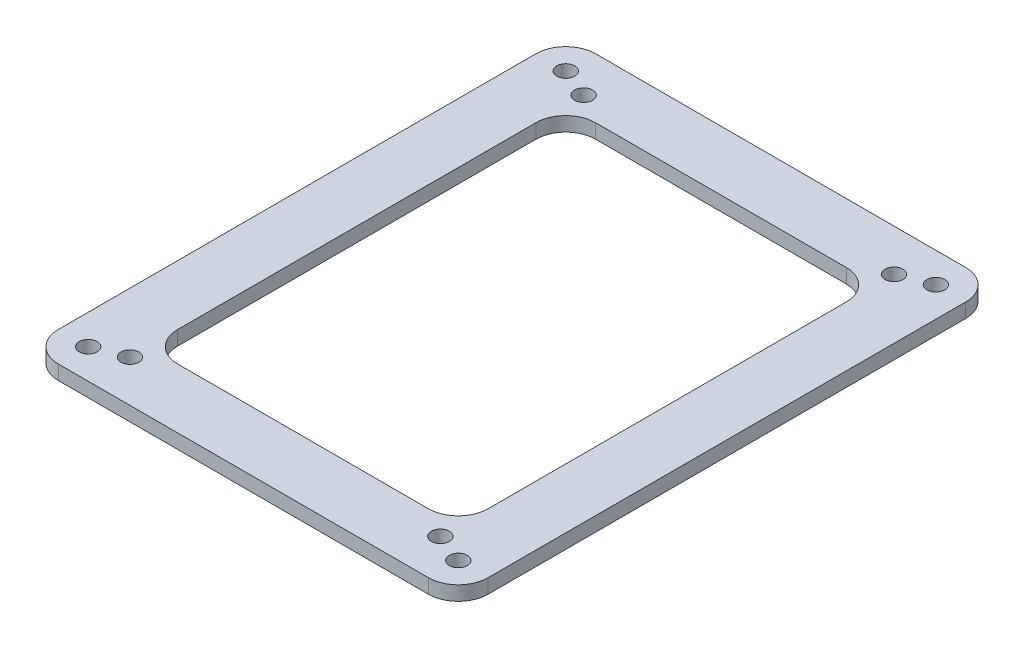
ISO-10303-21;
HEADER;
FILE_DESCRIPTION(('STEP AP214'),'2;1');
FILE_NAME('part.step','',(''),(''),'','','');
FILE_SCHEMA(('AUTOMOTIVE_DESIGN { 1 0 10303 214 1 1 1 1 }'));
ENDSEC;
DATA;
#1=APPLICATION_CONTEXT('core data for automotive mechanical design processes');
#2=APPLICATION_PROTOCOL_DEFINITION('international standard','automotive_design',2000,#1);
#3=PRODUCT_CONTEXT('',#1,'mechanical');
#4=PRODUCT('Part','Part','',(#3));
#5=PRODUCT_RELATED_PRODUCT_CATEGORY('part','',(#4));
#6=PRODUCT_DEFINITION_FORMATION('','',#4);
#7=PRODUCT_DEFINITION_CONTEXT('part definition',#1,'design');
#8=PRODUCT_DEFINITION('design','',#6,#7);
#9=PRODUCT_DEFINITION_SHAPE('','',#8);
#10=(LENGTH_UNIT() NAMED_UNIT(*) SI_UNIT(.MILLI.,.METRE.));
#11=(NAMED_UNIT(*) PLANE_ANGLE_UNIT() SI_UNIT($,.RADIAN.));
#12=(NAMED_UNIT(*) SI_UNIT($,.STERADIAN.) SOLID_ANGLE_UNIT());
#13=UNCERTAINTY_MEASURE_WITH_UNIT(LENGTH_MEASURE(1.E-05),#10,'distance_accuracy_value','');
#14=(GEOMETRIC_REPRESENTATION_CONTEXT(3) GLOBAL_UNCERTAINTY_ASSIGNED_CONTEXT((#13)) GLOBAL_UNIT_ASSIGNED_CONTEXT((#10,
#11,#12)) REPRESENTATION_CONTEXT('',''));
#15=CARTESIAN_POINT('',(0.,0.,0.));
#16=DIRECTION('',(0.,0.,1.));
#17=DIRECTION('',(1.,0.,0.));
#18=AXIS2_PLACEMENT_3D('',#15,#16,#17);
#19=CARTESIAN_POINT('',(-31.,2.4,-40.));
#20=DIRECTION('',(0.,-1.,0.));
#21=DIRECTION('',(0.,0.,-1.));
#22=AXIS2_PLACEMENT_3D('',#19,#20,#21);
#23=PLANE('',#22);
#24=CARTESIAN_POINT('',(31.,2.4,40.));
#25=DIRECTION('',(0.,1.,0.));
#26=DIRECTION('',(0.,0.,1.));
#27=AXIS2_PLACEMENT_3D('',#24,#25,#26);
#28=CIRCLE('',#27,1.50000000000001);
#29=CARTESIAN_POINT('',(31.,2.4,41.5));
#30=VERTEX_POINT('',#29);
#31=EDGE_CURVE('E246',#30,#30,#28,.T.);
#32=ORIENTED_EDGE('',*,*,#31,.F.);
#33=EDGE_LOOP('',(#32));
#34=FACE_BOUND('',#33,.T.);
#35=CARTESIAN_POINT('',(-31.,2.4,40.));
#36=DIRECTION('',(0.,1.,0.));
#37=DIRECTION('',(0.,0.,-1.));
#38=AXIS2_PLACEMENT_3D('',#35,#36,#37);
#39=CIRCLE('',#38,1.5);
#40=CARTESIAN_POINT('',(-31.,2.4,38.5));
#41=VERTEX_POINT('',#40);
#42=EDGE_CURVE('E252',#41,#41,#39,.T.);
#43=ORIENTED_EDGE('',*,*,#42,.F.);
#44=EDGE_LOOP('',(#43));
#45=FACE_BOUND('',#44,.T.);
#46=CARTESIAN_POINT('',(31.,2.4,-40.));
#47=DIRECTION('',(0.,1.,0.));
#48=DIRECTION('',(0.,0.,-1.));
#49=AXIS2_PLACEMENT_3D('',#46,#47,#48);
#50=CIRCLE('',#49,1.5);
#51=CARTESIAN_POINT('',(31.,2.4,-41.5));
#52=VERTEX_POINT('',#51);
#53=EDGE_CURVE('E258',#52,#52,#50,.T.);
#54=ORIENTED_EDGE('',*,*,#53,.F.);
#55=EDGE_LOOP('',(#54));
#56=FACE_BOUND('',#55,.T.);
#57=CARTESIAN_POINT('',(-31.,2.4,-40.));
#58=DIRECTION('',(0.,1.,0.));
#59=DIRECTION('',(0.,0.,1.));
#60=AXIS2_PLACEMENT_3D('',#57,#58,#59);
#61=CIRCLE('',#60,1.5);
#62=CARTESIAN_POINT('',(-31.,2.4,-38.5));
#63=VERTEX_POINT('',#62);
#64=EDGE_CURVE('E264',#63,#63,#61,.T.);
#65=ORIENTED_EDGE('',*,*,#64,.F.);
#66=EDGE_LOOP('',(#65));
#67=FACE_BOUND('',#66,.T.);
#68=CARTESIAN_POINT('',(-26.,2.4,38.));
#69=DIRECTION('',(0.,1.,0.));
#70=DIRECTION('',(0.,0.,-1.));
#71=AXIS2_PLACEMENT_3D('',#68,#69,#70);
#72=CIRCLE('',#71,1.5);
#73=CARTESIAN_POINT('',(-26.,2.4,36.5));
#74=VERTEX_POINT('',#73);
#75=EDGE_CURVE('E270',#74,#74,#72,.T.);
#76=ORIENTED_EDGE('',*,*,#75,.F.);
#77=EDGE_LOOP('',(#76));
#78=FACE_BOUND('',#77,.T.);
#79=CARTESIAN_POINT('',(26.,2.4,38.));
#80=DIRECTION('',(0.,1.,0.));
#81=DIRECTION('',(0.,0.,1.));
#82=AXIS2_PLACEMENT_3D('',#79,#80,#81);
#83=CIRCLE('',#82,1.5);
#84=CARTESIAN_POINT('',(26.,2.4,39.5));
#85=VERTEX_POINT('',#84);
#86=EDGE_CURVE('E276',#85,#85,#83,.T.);
#87=ORIENTED_EDGE('',*,*,#86,.F.);
#88=EDGE_LOOP('',(#87));
#89=FACE_BOUND('',#88,.T.);
#90=CARTESIAN_POINT('',(26.,2.4,-38.));
#91=DIRECTION('',(0.,1.,0.));
#92=DIRECTION('',(0.,0.,-1.));
#93=AXIS2_PLACEMENT_3D('',#90,#91,#92);
#94=CIRCLE('',#93,1.5);
#95=CARTESIAN_POINT('',(26.,2.4,-39.5));
#96=VERTEX_POINT('',#95);
#97=EDGE_CURVE('E282',#96,#96,#94,.T.);
#98=ORIENTED_EDGE('',*,*,#97,.F.);
#99=EDGE_LOOP('',(#98));
#100=FACE_BOUND('',#99,.T.);
#101=CARTESIAN_POINT('',(-26.,2.4,-38.));
#102=DIRECTION('',(0.,1.,0.));
#103=DIRECTION('',(0.,0.,1.));
#104=AXIS2_PLACEMENT_3D('',#101,#102,#103);
#105=CIRCLE('',#104,1.5);
#106=CARTESIAN_POINT('',(-26.,2.4,-36.5));
#107=VERTEX_POINT('',#106);
#108=EDGE_CURVE('E288',#107,#107,#105,.T.);
#109=ORIENTED_EDGE('',*,*,#108,.F.);
#110=EDGE_LOOP('',(#109));
#111=FACE_BOUND('',#110,.T.);
#112=CARTESIAN_POINT('',(-31.,2.4,-40.));
#113=DIRECTION('',(0.,1.,0.));
#114=DIRECTION('',(0.,0.,-1.));
#115=AXIS2_PLACEMENT_3D('',#112,#113,#114);
#116=CIRCLE('',#115,4.99999999999999);
#117=CARTESIAN_POINT('',(-31.,2.4,-45.));
#118=VERTEX_POINT('',#117);
#119=CARTESIAN_POINT('',(-36.,2.4,-40.));
#120=VERTEX_POINT('',#119);
#121=EDGE_CURVE('E160',#118,#120,#116,.T.);
#122=ORIENTED_EDGE('',*,*,#121,.T.);
#123=DIRECTION('',(0.,0.,1.));
#124=VECTOR('',#123,1.);
#125=CARTESIAN_POINT('',(-36.,2.4,-40.));
#126=LINE('',#125,#124);
#127=CARTESIAN_POINT('',(-36.,2.4,40.));
#128=VERTEX_POINT('',#127);
#129=EDGE_CURVE('E149',#120,#128,#126,.T.);
#130=ORIENTED_EDGE('',*,*,#129,.T.);
#131=CARTESIAN_POINT('',(-31.,2.4,40.));
#132=DIRECTION('',(0.,1.,0.));
#133=DIRECTION('',(0.,0.,1.));
#134=AXIS2_PLACEMENT_3D('',#131,#132,#133);
#135=CIRCLE('',#134,5.);
#136=CARTESIAN_POINT('',(-31.,2.4,45.));
#137=VERTEX_POINT('',#136);
#138=EDGE_CURVE('E159',#128,#137,#135,.T.);
#139=ORIENTED_EDGE('',*,*,#138,.T.);
#140=DIRECTION('',(1.,0.,0.));
#141=VECTOR('',#140,1.);
#142=CARTESIAN_POINT('',(-31.,2.4,45.));
#143=LINE('',#142,#141);
#144=CARTESIAN_POINT('',(31.,2.4,45.));
#145=VERTEX_POINT('',#144);
#146=EDGE_CURVE('E294',#137,#145,#143,.T.);
#147=ORIENTED_EDGE('',*,*,#146,.T.);
#148=CARTESIAN_POINT('',(31.,2.4,40.));
#149=DIRECTION('',(0.,1.,0.));
#150=DIRECTION('',(0.,0.,-1.));
#151=AXIS2_PLACEMENT_3D('',#148,#149,#150);
#152=CIRCLE('',#151,5.);
#153=CARTESIAN_POINT('',(36.,2.4,40.));
#154=VERTEX_POINT('',#153);
#155=EDGE_CURVE('E296',#145,#154,#152,.T.);
#156=ORIENTED_EDGE('',*,*,#155,.T.);
#157=DIRECTION('',(0.,0.,-1.));
#158=VECTOR('',#157,1.);
#159=CARTESIAN_POINT('',(36.,2.4,-40.));
#160=LINE('',#159,#158);
#161=CARTESIAN_POINT('',(36.,2.4,-40.));
#162=VERTEX_POINT('',#161);
#163=EDGE_CURVE('E298',#154,#162,#160,.T.);
#164=ORIENTED_EDGE('',*,*,#163,.T.);
#165=CARTESIAN_POINT('',(31.,2.4,-40.));
#166=DIRECTION('',(0.,1.,0.));
#167=DIRECTION('',(0.,0.,1.));
#168=AXIS2_PLACEMENT_3D('',#165,#166,#167);
#169=CIRCLE('',#168,4.99999999999999);
#170=CARTESIAN_POINT('',(31.,2.4,-45.));
#171=VERTEX_POINT('',#170);
#172=EDGE_CURVE('E300',#162,#171,#169,.T.);
#173=ORIENTED_EDGE('',*,*,#172,.T.);
#174=DIRECTION('',(-1.,0.,0.));
#175=VECTOR('',#174,1.);
#176=CARTESIAN_POINT('',(-31.,2.4,-45.));
#177=LINE('',#176,#175);
#178=EDGE_CURVE('E164',#171,#118,#177,.T.);
#179=ORIENTED_EDGE('',*,*,#178,.T.);
#180=EDGE_LOOP('',(#122,#130,#139,#147,#156,#164,#173,#179));
#181=FACE_BOUND('',#180,.T.);
#182=DIRECTION('',(-1.,0.,0.));
#183=VECTOR('',#182,1.);
#184=CARTESIAN_POINT('',(-26.,2.4,-35.));
#185=LINE('',#184,#183);
#186=CARTESIAN_POINT('',(21.,2.4,-35.));
#187=VERTEX_POINT('',#186);
#188=CARTESIAN_POINT('',(-21.,2.4,-35.));
#189=VERTEX_POINT('',#188);
#190=EDGE_CURVE('E230',#187,#189,#185,.T.);
#191=ORIENTED_EDGE('',*,*,#190,.F.);
#192=CARTESIAN_POINT('',(21.,2.4,-30.));
#193=DIRECTION('',(0.,-1.,0.));
#194=DIRECTION('',(0.,0.,-1.));
#195=AXIS2_PLACEMENT_3D('',#192,#193,#194);
#196=CIRCLE('',#195,5.);
#197=CARTESIAN_POINT('',(26.,2.4,-30.));
#198=VERTEX_POINT('',#197);
#199=EDGE_CURVE('E203',#187,#198,#196,.T.);
#200=ORIENTED_EDGE('',*,*,#199,.T.);
#201=DIRECTION('',(0.,0.,-1.));
#202=VECTOR('',#201,1.);
#203=CARTESIAN_POINT('',(26.,2.4,-35.));
#204=LINE('',#203,#202);
#205=CARTESIAN_POINT('',(26.,2.4,30.));
#206=VERTEX_POINT('',#205);
#207=EDGE_CURVE('E232',#206,#198,#204,.T.);
#208=ORIENTED_EDGE('',*,*,#207,.F.);
#209=CARTESIAN_POINT('',(21.,2.4,30.));
#210=DIRECTION('',(0.,-1.,0.));
#211=DIRECTION('',(0.,0.,-1.));
#212=AXIS2_PLACEMENT_3D('',#209,#210,#211);
#213=CIRCLE('',#212,5.);
#214=CARTESIAN_POINT('',(21.,2.4,35.));
#215=VERTEX_POINT('',#214);
#216=EDGE_CURVE('E50',#206,#215,#213,.T.);
#217=ORIENTED_EDGE('',*,*,#216,.T.);
#218=DIRECTION('',(1.,0.,0.));
#219=VECTOR('',#218,1.);
#220=CARTESIAN_POINT('',(-26.,2.4,35.));
#221=LINE('',#220,#219);
#222=CARTESIAN_POINT('',(-21.,2.4,35.));
#223=VERTEX_POINT('',#222);
#224=EDGE_CURVE('E226',#223,#215,#221,.T.);
#225=ORIENTED_EDGE('',*,*,#224,.F.);
#226=CARTESIAN_POINT('',(-21.,2.4,30.));
#227=DIRECTION('',(0.,-1.,0.));
#228=DIRECTION('',(0.,0.,-1.));
#229=AXIS2_PLACEMENT_3D('',#226,#227,#228);
#230=CIRCLE('',#229,5.);
#231=CARTESIAN_POINT('',(-26.,2.4,30.));
#232=VERTEX_POINT('',#231);
#233=EDGE_CURVE('E11',#223,#232,#230,.T.);
#234=ORIENTED_EDGE('',*,*,#233,.T.);
#235=DIRECTION('',(0.,0.,1.));
#236=VECTOR('',#235,1.);
#237=CARTESIAN_POINT('',(-26.,2.4,-35.));
#238=LINE('',#237,#236);
#239=CARTESIAN_POINT('',(-26.,2.4,-30.));
#240=VERTEX_POINT('',#239);
#241=EDGE_CURVE('E224',#240,#232,#238,.T.);
#242=ORIENTED_EDGE('',*,*,#241,.F.);
#243=CARTESIAN_POINT('',(-21.,2.4,-30.));
#244=DIRECTION('',(0.,-1.,0.));
#245=DIRECTION('',(0.,0.,-1.));
#246=AXIS2_PLACEMENT_3D('',#243,#244,#245);
#247=CIRCLE('',#246,5.);
#248=EDGE_CURVE('E199',#240,#189,#247,.T.);
#249=ORIENTED_EDGE('',*,*,#248,.T.);
#250=EDGE_LOOP('',(#191,#200,#208,#217,#225,#234,#242,#249));
#251=FACE_BOUND('',#250,.T.);
#252=ADVANCED_FACE('F35',(#34,#45,#56,#67,#78,#89,#100,#111,#181,#251),#23,.F.);
#253=CARTESIAN_POINT('',(-31.,0.,-40.));
#254=DIRECTION('',(0.,-1.,0.));
#255=DIRECTION('',(0.,0.,-1.));
#256=AXIS2_PLACEMENT_3D('',#253,#254,#255);
#257=PLANE('',#256);
#258=CARTESIAN_POINT('',(-31.,0.,40.));
#259=DIRECTION('',(0.,1.,0.));
#260=DIRECTION('',(0.,0.,-1.));
#261=AXIS2_PLACEMENT_3D('',#258,#259,#260);
#262=CIRCLE('',#261,1.5);
#263=CARTESIAN_POINT('',(-31.,0.,38.5));
#264=VERTEX_POINT('',#263);
#265=EDGE_CURVE('E249',#264,#264,#262,.T.);
#266=ORIENTED_EDGE('',*,*,#265,.T.);
#267=EDGE_LOOP('',(#266));
#268=FACE_BOUND('',#267,.T.);
#269=CARTESIAN_POINT('',(-31.,0.,-40.));
#270=DIRECTION('',(0.,1.,0.));
#271=DIRECTION('',(0.,0.,1.));
#272=AXIS2_PLACEMENT_3D('',#269,#270,#271);
#273=CIRCLE('',#272,1.5);
#274=CARTESIAN_POINT('',(-31.,0.,-38.5));
#275=VERTEX_POINT('',#274);
#276=EDGE_CURVE('E261',#275,#275,#273,.T.);
#277=ORIENTED_EDGE('',*,*,#276,.T.);
#278=EDGE_LOOP('',(#277));
#279=FACE_BOUND('',#278,.T.);
#280=CARTESIAN_POINT('',(26.,0.,38.));
#281=DIRECTION('',(0.,1.,0.));
#282=DIRECTION('',(0.,0.,1.));
#283=AXIS2_PLACEMENT_3D('',#280,#281,#282);
#284=CIRCLE('',#283,1.5);
#285=CARTESIAN_POINT('',(26.,0.,39.5));
#286=VERTEX_POINT('',#285);
#287=EDGE_CURVE('E273',#286,#286,#284,.T.);
#288=ORIENTED_EDGE('',*,*,#287,.T.);
#289=EDGE_LOOP('',(#288));
#290=FACE_BOUND('',#289,.T.);
#291=CARTESIAN_POINT('',(-26.,0.,-38.));
#292=DIRECTION('',(0.,1.,0.));
#293=DIRECTION('',(0.,0.,1.));
#294=AXIS2_PLACEMENT_3D('',#291,#292,#293);
#295=CIRCLE('',#294,1.5);
#296=CARTESIAN_POINT('',(-26.,0.,-36.5));
#297=VERTEX_POINT('',#296);
#298=EDGE_CURVE('E285',#297,#297,#295,.T.);
#299=ORIENTED_EDGE('',*,*,#298,.T.);
#300=EDGE_LOOP('',(#299));
#301=FACE_BOUND('',#300,.T.);
#302=CARTESIAN_POINT('',(-31.,0.,-40.));
#303=DIRECTION('',(0.,1.,0.));
#304=DIRECTION('',(0.,0.,-1.));
#305=AXIS2_PLACEMENT_3D('',#302,#303,#304);
#306=CIRCLE('',#305,4.99999999999999);
#307=CARTESIAN_POINT('',(-31.,0.,-45.));
#308=VERTEX_POINT('',#307);
#309=CARTESIAN_POINT('',(-36.,0.,-40.));
#310=VERTEX_POINT('',#309);
#311=EDGE_CURVE('E172',#308,#310,#306,.T.);
#312=ORIENTED_EDGE('',*,*,#311,.F.);
#313=DIRECTION('',(-1.,0.,0.));
#314=VECTOR('',#313,1.);
#315=CARTESIAN_POINT('',(-31.,0.,-45.));
#316=LINE('',#315,#314);
#317=CARTESIAN_POINT('',(31.,0.,-45.));
#318=VERTEX_POINT('',#317);
#319=EDGE_CURVE('E168',#318,#308,#316,.T.);
#320=ORIENTED_EDGE('',*,*,#319,.F.);
#321=CARTESIAN_POINT('',(31.,0.,-40.));
#322=DIRECTION('',(0.,1.,0.));
#323=DIRECTION('',(0.,0.,1.));
#324=AXIS2_PLACEMENT_3D('',#321,#322,#323);
#325=CIRCLE('',#324,4.99999999999999);
#326=CARTESIAN_POINT('',(36.,0.,-40.));
#327=VERTEX_POINT('',#326);
#328=EDGE_CURVE('E315',#327,#318,#325,.T.);
#329=ORIENTED_EDGE('',*,*,#328,.F.);
#330=DIRECTION('',(0.,0.,-1.));
#331=VECTOR('',#330,1.);
#332=CARTESIAN_POINT('',(36.,0.,-40.));
#333=LINE('',#332,#331);
#334=CARTESIAN_POINT('',(36.,0.,40.));
#335=VERTEX_POINT('',#334);
#336=EDGE_CURVE('E313',#335,#327,#333,.T.);
#337=ORIENTED_EDGE('',*,*,#336,.F.);
#338=CARTESIAN_POINT('',(31.,0.,40.));
#339=DIRECTION('',(0.,1.,0.));
#340=DIRECTION('',(0.,0.,-1.));
#341=AXIS2_PLACEMENT_3D('',#338,#339,#340);
#342=CIRCLE('',#341,5.);
#343=CARTESIAN_POINT('',(31.,0.,45.));
#344=VERTEX_POINT('',#343);
#345=EDGE_CURVE('E311',#344,#335,#342,.T.);
#346=ORIENTED_EDGE('',*,*,#345,.F.);
#347=DIRECTION('',(1.,0.,0.));
#348=VECTOR('',#347,1.);
#349=CARTESIAN_POINT('',(-31.,0.,45.));
#350=LINE('',#349,#348);
#351=CARTESIAN_POINT('',(-31.,0.,45.));
#352=VERTEX_POINT('',#351);
#353=EDGE_CURVE('E309',#352,#344,#350,.T.);
#354=ORIENTED_EDGE('',*,*,#353,.F.);
#355=CARTESIAN_POINT('',(-31.,0.,40.));
#356=DIRECTION('',(0.,1.,0.));
#357=DIRECTION('',(0.,0.,1.));
#358=AXIS2_PLACEMENT_3D('',#355,#356,#357);
#359=CIRCLE('',#358,5.);
#360=CARTESIAN_POINT('',(-36.,0.,40.));
#361=VERTEX_POINT('',#360);
#362=EDGE_CURVE('E307',#361,#352,#359,.T.);
#363=ORIENTED_EDGE('',*,*,#362,.F.);
#364=DIRECTION('',(0.,0.,1.));
#365=VECTOR('',#364,1.);
#366=CARTESIAN_POINT('',(-36.,0.,-40.));
#367=LINE('',#366,#365);
#368=EDGE_CURVE('E305',#310,#361,#367,.T.);
#369=ORIENTED_EDGE('',*,*,#368,.F.);
#370=EDGE_LOOP('',(#312,#320,#329,#337,#346,#354,#363,#369));
#371=FACE_BOUND('',#370,.T.);
#372=CARTESIAN_POINT('',(26.,0.,-38.));
#373=DIRECTION('',(0.,1.,0.));
#374=DIRECTION('',(0.,0.,-1.));
#375=AXIS2_PLACEMENT_3D('',#372,#373,#374);
#376=CIRCLE('',#375,1.5);
#377=CARTESIAN_POINT('',(26.,0.,-39.5));
#378=VERTEX_POINT('',#377);
#379=EDGE_CURVE('E279',#378,#378,#376,.T.);
#380=ORIENTED_EDGE('',*,*,#379,.T.);
#381=EDGE_LOOP('',(#380));
#382=FACE_BOUND('',#381,.T.);
#383=CARTESIAN_POINT('',(-26.,0.,38.));
#384=DIRECTION('',(0.,1.,0.));
#385=DIRECTION('',(0.,0.,-1.));
#386=AXIS2_PLACEMENT_3D('',#383,#384,#385);
#387=CIRCLE('',#386,1.5);
#388=CARTESIAN_POINT('',(-26.,0.,36.5));
#389=VERTEX_POINT('',#388);
#390=EDGE_CURVE('E267',#389,#389,#387,.T.);
#391=ORIENTED_EDGE('',*,*,#390,.T.);
#392=EDGE_LOOP('',(#391));
#393=FACE_BOUND('',#392,.T.);
#394=CARTESIAN_POINT('',(31.,0.,-40.));
#395=DIRECTION('',(0.,1.,0.));
#396=DIRECTION('',(0.,0.,-1.));
#397=AXIS2_PLACEMENT_3D('',#394,#395,#396);
#398=CIRCLE('',#397,1.5);
#399=CARTESIAN_POINT('',(31.,0.,-41.5));
#400=VERTEX_POINT('',#399);
#401=EDGE_CURVE('E255',#400,#400,#398,.T.);
#402=ORIENTED_EDGE('',*,*,#401,.T.);
#403=EDGE_LOOP('',(#402));
#404=FACE_BOUND('',#403,.T.);
#405=CARTESIAN_POINT('',(31.,0.,40.));
#406=DIRECTION('',(0.,1.,0.));
#407=DIRECTION('',(0.,0.,1.));
#408=AXIS2_PLACEMENT_3D('',#405,#406,#407);
#409=CIRCLE('',#408,1.50000000000001);
#410=CARTESIAN_POINT('',(31.,0.,41.5));
#411=VERTEX_POINT('',#410);
#412=EDGE_CURVE('E239',#411,#411,#409,.T.);
#413=ORIENTED_EDGE('',*,*,#412,.T.);
#414=EDGE_LOOP('',(#413));
#415=FACE_BOUND('',#414,.T.);
#416=DIRECTION('',(1.,0.,0.));
#417=VECTOR('',#416,1.);
#418=CARTESIAN_POINT('',(-26.,0.,35.));
#419=LINE('',#418,#417);
#420=CARTESIAN_POINT('',(-21.,0.,35.));
#421=VERTEX_POINT('',#420);
#422=CARTESIAN_POINT('',(21.,0.,35.));
#423=VERTEX_POINT('',#422);
#424=EDGE_CURVE('E211',#421,#423,#419,.T.);
#425=ORIENTED_EDGE('',*,*,#424,.T.);
#426=CARTESIAN_POINT('',(21.,0.,30.));
#427=DIRECTION('',(0.,-1.,0.));
#428=DIRECTION('',(0.,0.,-1.));
#429=AXIS2_PLACEMENT_3D('',#426,#427,#428);
#430=CIRCLE('',#429,5.);
#431=CARTESIAN_POINT('',(26.,0.,30.));
#432=VERTEX_POINT('',#431);
#433=EDGE_CURVE('E205',#423,#432,#430,.F.);
#434=ORIENTED_EDGE('',*,*,#433,.T.);
#435=DIRECTION('',(0.,0.,-1.));
#436=VECTOR('',#435,1.);
#437=CARTESIAN_POINT('',(26.,0.,-35.));
#438=LINE('',#437,#436);
#439=CARTESIAN_POINT('',(26.,0.,-30.));
#440=VERTEX_POINT('',#439);
#441=EDGE_CURVE('E218',#432,#440,#438,.T.);
#442=ORIENTED_EDGE('',*,*,#441,.T.);
#443=CARTESIAN_POINT('',(21.,0.,-30.));
#444=DIRECTION('',(0.,-1.,0.));
#445=DIRECTION('',(0.,0.,-1.));
#446=AXIS2_PLACEMENT_3D('',#443,#444,#445);
#447=CIRCLE('',#446,5.);
#448=CARTESIAN_POINT('',(21.,0.,-35.));
#449=VERTEX_POINT('',#448);
#450=EDGE_CURVE('E201',#440,#449,#447,.F.);
#451=ORIENTED_EDGE('',*,*,#450,.T.);
#452=DIRECTION('',(-1.,0.,0.));
#453=VECTOR('',#452,1.);
#454=CARTESIAN_POINT('',(-26.,0.,-35.));
#455=LINE('',#454,#453);
#456=CARTESIAN_POINT('',(-21.,0.,-35.));
#457=VERTEX_POINT('',#456);
#458=EDGE_CURVE('E240',#449,#457,#455,.T.);
#459=ORIENTED_EDGE('',*,*,#458,.T.);
#460=CARTESIAN_POINT('',(-21.,0.,-30.));
#461=DIRECTION('',(0.,-1.,0.));
#462=DIRECTION('',(0.,0.,-1.));
#463=AXIS2_PLACEMENT_3D('',#460,#461,#462);
#464=CIRCLE('',#463,5.);
#465=CARTESIAN_POINT('',(-26.,0.,-30.));
#466=VERTEX_POINT('',#465);
#467=EDGE_CURVE('E197',#457,#466,#464,.F.);
#468=ORIENTED_EDGE('',*,*,#467,.T.);
#469=DIRECTION('',(0.,0.,1.));
#470=VECTOR('',#469,1.);
#471=CARTESIAN_POINT('',(-26.,0.,-35.));
#472=LINE('',#471,#470);
#473=CARTESIAN_POINT('',(-26.,0.,30.));
#474=VERTEX_POINT('',#473);
#475=EDGE_CURVE('E213',#466,#474,#472,.T.);
#476=ORIENTED_EDGE('',*,*,#475,.T.);
#477=CARTESIAN_POINT('',(-21.,0.,30.));
#478=DIRECTION('',(0.,-1.,0.));
#479=DIRECTION('',(0.,0.,-1.));
#480=AXIS2_PLACEMENT_3D('',#477,#478,#479);
#481=CIRCLE('',#480,5.);
#482=EDGE_CURVE('E43',#474,#421,#481,.F.);
#483=ORIENTED_EDGE('',*,*,#482,.T.);
#484=EDGE_LOOP('',(#425,#434,#442,#451,#459,#468,#476,#483));
#485=FACE_BOUND('',#484,.T.);
#486=ADVANCED_FACE('F210',(#268,#279,#290,#301,#371,#382,#393,#404,#415,#485),#257,.T.);
#487=CARTESIAN_POINT('',(-31.,2.4,-40.));
#488=DIRECTION('',(0.,-1.,0.));
#489=DIRECTION('',(0.,0.,-1.));
#490=AXIS2_PLACEMENT_3D('',#487,#488,#489);
#491=CYLINDRICAL_SURFACE('',#490,4.99999999999999);
#492=ORIENTED_EDGE('',*,*,#311,.T.);
#493=DIRECTION('',(0.,-1.,0.));
#494=VECTOR('',#493,1.);
#495=CARTESIAN_POINT('',(-36.,2.4,-40.));
#496=LINE('',#495,#494);
#497=EDGE_CURVE('E153',#120,#310,#496,.T.);
#498=ORIENTED_EDGE('',*,*,#497,.F.);
#499=ORIENTED_EDGE('',*,*,#121,.F.);
#500=DIRECTION('',(0.,-1.,0.));
#501=VECTOR('',#500,1.);
#502=CARTESIAN_POINT('',(-31.,2.4,-45.));
#503=LINE('',#502,#501);
#504=EDGE_CURVE('E303',#118,#308,#503,.T.);
#505=ORIENTED_EDGE('',*,*,#504,.T.);
#506=EDGE_LOOP('',(#492,#498,#499,#505));
#507=FACE_BOUND('',#506,.T.);
#508=ADVANCED_FACE('F170',(#507),#491,.T.);
#509=CARTESIAN_POINT('',(-36.,2.4,-40.));
#510=DIRECTION('',(1.,0.,0.));
#511=DIRECTION('',(0.,0.,-1.));
#512=AXIS2_PLACEMENT_3D('',#509,#510,#511);
#513=PLANE('',#512);
#514=ORIENTED_EDGE('',*,*,#368,.T.);
#515=DIRECTION('',(0.,-1.,0.));
#516=VECTOR('',#515,1.);
#517=CARTESIAN_POINT('',(-36.,2.4,40.));
#518=LINE('',#517,#516);
#519=EDGE_CURVE('E156',#128,#361,#518,.T.);
#520=ORIENTED_EDGE('',*,*,#519,.F.);
#521=ORIENTED_EDGE('',*,*,#129,.F.);
#522=ORIENTED_EDGE('',*,*,#497,.T.);
#523=EDGE_LOOP('',(#514,#520,#521,#522));
#524=FACE_BOUND('',#523,.T.);
#525=ADVANCED_FACE('F151',(#524),#513,.F.);
#526=CARTESIAN_POINT('',(-31.,2.4,40.));
#527=DIRECTION('',(0.,-1.,0.));
#528=DIRECTION('',(0.,0.,-1.));
#529=AXIS2_PLACEMENT_3D('',#526,#527,#528);
#530=CYLINDRICAL_SURFACE('',#529,5.);
#531=ORIENTED_EDGE('',*,*,#362,.T.);
#532=DIRECTION('',(0.,-1.,0.));
#533=VECTOR('',#532,1.);
#534=CARTESIAN_POINT('',(-31.,2.4,45.));
#535=LINE('',#534,#533);
#536=EDGE_CURVE('E177',#137,#352,#535,.T.);
#537=ORIENTED_EDGE('',*,*,#536,.F.);
#538=ORIENTED_EDGE('',*,*,#138,.F.);
#539=ORIENTED_EDGE('',*,*,#519,.T.);
#540=EDGE_LOOP('',(#531,#537,#538,#539));
#541=FACE_BOUND('',#540,.T.);
#542=ADVANCED_FACE('F354',(#541),#530,.T.);
#543=CARTESIAN_POINT('',(-31.,2.4,45.));
#544=DIRECTION('',(0.,0.,-1.));
#545=DIRECTION('',(-1.,0.,0.));
#546=AXIS2_PLACEMENT_3D('',#543,#544,#545);
#547=PLANE('',#546);
#548=ORIENTED_EDGE('',*,*,#353,.T.);
#549=DIRECTION('',(0.,-1.,0.));
#550=VECTOR('',#549,1.);
#551=CARTESIAN_POINT('',(31.,2.4,45.));
#552=LINE('',#551,#550);
#553=EDGE_CURVE('E328',#145,#344,#552,.T.);
#554=ORIENTED_EDGE('',*,*,#553,.F.);
#555=ORIENTED_EDGE('',*,*,#146,.F.);
#556=ORIENTED_EDGE('',*,*,#536,.T.);
#557=EDGE_LOOP('',(#548,#554,#555,#556));
#558=FACE_BOUND('',#557,.T.);
#559=ADVANCED_FACE('F335',(#558),#547,.F.);
#560=CARTESIAN_POINT('',(31.,2.4,40.));
#561=DIRECTION('',(0.,-1.,0.));
#562=DIRECTION('',(0.,0.,-1.));
#563=AXIS2_PLACEMENT_3D('',#560,#561,#562);
#564=CYLINDRICAL_SURFACE('',#563,5.);
#565=ORIENTED_EDGE('',*,*,#345,.T.);
#566=DIRECTION('',(0.,-1.,0.));
#567=VECTOR('',#566,1.);
#568=CARTESIAN_POINT('',(36.,2.4,40.));
#569=LINE('',#568,#567);
#570=EDGE_CURVE('E325',#154,#335,#569,.T.);
#571=ORIENTED_EDGE('',*,*,#570,.F.);
#572=ORIENTED_EDGE('',*,*,#155,.F.);
#573=ORIENTED_EDGE('',*,*,#553,.T.);
#574=EDGE_LOOP('',(#565,#571,#572,#573));
#575=FACE_BOUND('',#574,.T.);
#576=ADVANCED_FACE('F346',(#575),#564,.T.);
#577=CARTESIAN_POINT('',(36.,2.4,-40.));
#578=DIRECTION('',(-1.,0.,0.));
#579=DIRECTION('',(0.,0.,1.));
#580=AXIS2_PLACEMENT_3D('',#577,#578,#579);
#581=PLANE('',#580);
#582=ORIENTED_EDGE('',*,*,#336,.T.);
#583=DIRECTION('',(0.,-1.,0.));
#584=VECTOR('',#583,1.);
#585=CARTESIAN_POINT('',(36.,2.4,-40.));
#586=LINE('',#585,#584);
#587=EDGE_CURVE('E322',#162,#327,#586,.T.);
#588=ORIENTED_EDGE('',*,*,#587,.F.);
#589=ORIENTED_EDGE('',*,*,#163,.F.);
#590=ORIENTED_EDGE('',*,*,#570,.T.);
#591=EDGE_LOOP('',(#582,#588,#589,#590));
#592=FACE_BOUND('',#591,.T.);
#593=ADVANCED_FACE('F350',(#592),#581,.F.);
#594=CARTESIAN_POINT('',(31.,2.4,-40.));
#595=DIRECTION('',(0.,-1.,0.));
#596=DIRECTION('',(0.,0.,-1.));
#597=AXIS2_PLACEMENT_3D('',#594,#595,#596);
#598=CYLINDRICAL_SURFACE('',#597,4.99999999999999);
#599=ORIENTED_EDGE('',*,*,#328,.T.);
#600=DIRECTION('',(0.,-1.,0.));
#601=VECTOR('',#600,1.);
#602=CARTESIAN_POINT('',(31.,2.4,-45.));
#603=LINE('',#602,#601);
#604=EDGE_CURVE('E319',#171,#318,#603,.T.);
#605=ORIENTED_EDGE('',*,*,#604,.F.);
#606=ORIENTED_EDGE('',*,*,#172,.F.);
#607=ORIENTED_EDGE('',*,*,#587,.T.);
#608=EDGE_LOOP('',(#599,#605,#606,#607));
#609=FACE_BOUND('',#608,.T.);
#610=ADVANCED_FACE('F380',(#609),#598,.T.);
#611=CARTESIAN_POINT('',(-31.,2.4,-45.));
#612=DIRECTION('',(0.,0.,1.));
#613=DIRECTION('',(1.,0.,0.));
#614=AXIS2_PLACEMENT_3D('',#611,#612,#613);
#615=PLANE('',#614);
#616=ORIENTED_EDGE('',*,*,#319,.T.);
#617=ORIENTED_EDGE('',*,*,#504,.F.);
#618=ORIENTED_EDGE('',*,*,#178,.F.);
#619=ORIENTED_EDGE('',*,*,#604,.T.);
#620=EDGE_LOOP('',(#616,#617,#618,#619));
#621=FACE_BOUND('',#620,.T.);
#622=ADVANCED_FACE('F377',(#621),#615,.F.);
#623=CARTESIAN_POINT('',(-26.,2.4,-38.));
#624=DIRECTION('',(0.,-1.,0.));
#625=DIRECTION('',(0.,0.,-1.));
#626=AXIS2_PLACEMENT_3D('',#623,#624,#625);
#627=CYLINDRICAL_SURFACE('',#626,1.5);
#628=ORIENTED_EDGE('',*,*,#108,.T.);
#629=EDGE_LOOP('',(#628));
#630=FACE_BOUND('',#629,.T.);
#631=ORIENTED_EDGE('',*,*,#298,.F.);
#632=EDGE_LOOP('',(#631));
#633=FACE_BOUND('',#632,.T.);
#634=ADVANCED_FACE('F374',(#630,#633),#627,.F.);
#635=CARTESIAN_POINT('',(26.,2.4,-38.));
#636=DIRECTION('',(0.,-1.,0.));
#637=DIRECTION('',(0.,0.,-1.));
#638=AXIS2_PLACEMENT_3D('',#635,#636,#637);
#639=CYLINDRICAL_SURFACE('',#638,1.5);
#640=ORIENTED_EDGE('',*,*,#97,.T.);
#641=EDGE_LOOP('',(#640));
#642=FACE_BOUND('',#641,.T.);
#643=ORIENTED_EDGE('',*,*,#379,.F.);
#644=EDGE_LOOP('',(#643));
#645=FACE_BOUND('',#644,.T.);
#646=ADVANCED_FACE('F410',(#642,#645),#639,.F.);
#647=CARTESIAN_POINT('',(26.,2.4,38.));
#648=DIRECTION('',(0.,-1.,0.));
#649=DIRECTION('',(0.,0.,-1.));
#650=AXIS2_PLACEMENT_3D('',#647,#648,#649);
#651=CYLINDRICAL_SURFACE('',#650,1.5);
#652=ORIENTED_EDGE('',*,*,#86,.T.);
#653=EDGE_LOOP('',(#652));
#654=FACE_BOUND('',#653,.T.);
#655=ORIENTED_EDGE('',*,*,#287,.F.);
#656=EDGE_LOOP('',(#655));
#657=FACE_BOUND('',#656,.T.);
#658=ADVANCED_FACE('F417',(#654,#657),#651,.F.);
#659=CARTESIAN_POINT('',(-26.,2.4,38.));
#660=DIRECTION('',(0.,-1.,0.));
#661=DIRECTION('',(0.,0.,-1.));
#662=AXIS2_PLACEMENT_3D('',#659,#660,#661);
#663=CYLINDRICAL_SURFACE('',#662,1.5);
#664=ORIENTED_EDGE('',*,*,#75,.T.);
#665=EDGE_LOOP('',(#664));
#666=FACE_BOUND('',#665,.T.);
#667=ORIENTED_EDGE('',*,*,#390,.F.);
#668=EDGE_LOOP('',(#667));
#669=FACE_BOUND('',#668,.T.);
#670=ADVANCED_FACE('F424',(#666,#669),#663,.F.);
#671=CARTESIAN_POINT('',(-31.,2.4,-40.));
#672=DIRECTION('',(0.,-1.,0.));
#673=DIRECTION('',(0.,0.,-1.));
#674=AXIS2_PLACEMENT_3D('',#671,#672,#673);
#675=CYLINDRICAL_SURFACE('',#674,1.5);
#676=ORIENTED_EDGE('',*,*,#64,.T.);
#677=EDGE_LOOP('',(#676));
#678=FACE_BOUND('',#677,.T.);
#679=ORIENTED_EDGE('',*,*,#276,.F.);
#680=EDGE_LOOP('',(#679));
#681=FACE_BOUND('',#680,.T.);
#682=ADVANCED_FACE('F432',(#678,#681),#675,.F.);
#683=CARTESIAN_POINT('',(31.,2.4,-40.));
#684=DIRECTION('',(0.,-1.,0.));
#685=DIRECTION('',(0.,0.,-1.));
#686=AXIS2_PLACEMENT_3D('',#683,#684,#685);
#687=CYLINDRICAL_SURFACE('',#686,1.5);
#688=ORIENTED_EDGE('',*,*,#53,.T.);
#689=EDGE_LOOP('',(#688));
#690=FACE_BOUND('',#689,.T.);
#691=ORIENTED_EDGE('',*,*,#401,.F.);
#692=EDGE_LOOP('',(#691));
#693=FACE_BOUND('',#692,.T.);
#694=ADVANCED_FACE('F440',(#690,#693),#687,.F.);
#695=CARTESIAN_POINT('',(-31.,2.4,40.));
#696=DIRECTION('',(0.,-1.,0.));
#697=DIRECTION('',(0.,0.,-1.));
#698=AXIS2_PLACEMENT_3D('',#695,#696,#697);
#699=CYLINDRICAL_SURFACE('',#698,1.5);
#700=ORIENTED_EDGE('',*,*,#42,.T.);
#701=EDGE_LOOP('',(#700));
#702=FACE_BOUND('',#701,.T.);
#703=ORIENTED_EDGE('',*,*,#265,.F.);
#704=EDGE_LOOP('',(#703));
#705=FACE_BOUND('',#704,.T.);
#706=ADVANCED_FACE('F448',(#702,#705),#699,.F.);
#707=CARTESIAN_POINT('',(31.,2.4,40.));
#708=DIRECTION('',(0.,-1.,0.));
#709=DIRECTION('',(0.,0.,-1.));
#710=AXIS2_PLACEMENT_3D('',#707,#708,#709);
#711=CYLINDRICAL_SURFACE('',#710,1.50000000000001);
#712=ORIENTED_EDGE('',*,*,#31,.T.);
#713=EDGE_LOOP('',(#712));
#714=FACE_BOUND('',#713,.T.);
#715=ORIENTED_EDGE('',*,*,#412,.F.);
#716=EDGE_LOOP('',(#715));
#717=FACE_BOUND('',#716,.T.);
#718=ADVANCED_FACE('F456',(#714,#717),#711,.F.);
#719=CARTESIAN_POINT('',(-26.,2.4,-35.));
#720=DIRECTION('',(0.,0.,1.));
#721=DIRECTION('',(1.,0.,0.));
#722=AXIS2_PLACEMENT_3D('',#719,#720,#721);
#723=PLANE('',#722);
#724=ORIENTED_EDGE('',*,*,#190,.T.);
#725=DIRECTION('',(0.,-1.,0.));
#726=VECTOR('',#725,1.);
#727=CARTESIAN_POINT('',(-21.,0.,-35.));
#728=LINE('',#727,#726);
#729=EDGE_CURVE('E175',#189,#457,#728,.T.);
#730=ORIENTED_EDGE('',*,*,#729,.T.);
#731=ORIENTED_EDGE('',*,*,#458,.F.);
#732=DIRECTION('',(0.,-1.,0.));
#733=VECTOR('',#732,1.);
#734=CARTESIAN_POINT('',(21.,2.4,-35.));
#735=LINE('',#734,#733);
#736=EDGE_CURVE('E173',#449,#187,#735,.F.);
#737=ORIENTED_EDGE('',*,*,#736,.T.);
#738=EDGE_LOOP('',(#724,#730,#731,#737));
#739=FACE_BOUND('',#738,.T.);
#740=ADVANCED_FACE('F464',(#739),#723,.T.);
#741=CARTESIAN_POINT('',(-26.,2.4,-35.));
#742=DIRECTION('',(1.,0.,0.));
#743=DIRECTION('',(0.,0.,-1.));
#744=AXIS2_PLACEMENT_3D('',#741,#742,#743);
#745=PLANE('',#744);
#746=ORIENTED_EDGE('',*,*,#475,.F.);
#747=DIRECTION('',(0.,-1.,0.));
#748=VECTOR('',#747,1.);
#749=CARTESIAN_POINT('',(-26.,2.4,-30.));
#750=LINE('',#749,#748);
#751=EDGE_CURVE('E186',#466,#240,#750,.F.);
#752=ORIENTED_EDGE('',*,*,#751,.T.);
#753=ORIENTED_EDGE('',*,*,#241,.T.);
#754=DIRECTION('',(0.,-1.,0.));
#755=VECTOR('',#754,1.);
#756=CARTESIAN_POINT('',(-26.,0.,30.));
#757=LINE('',#756,#755);
#758=EDGE_CURVE('E183',#232,#474,#757,.T.);
#759=ORIENTED_EDGE('',*,*,#758,.T.);
#760=EDGE_LOOP('',(#746,#752,#753,#759));
#761=FACE_BOUND('',#760,.T.);
#762=ADVANCED_FACE('F228',(#761),#745,.T.);
#763=CARTESIAN_POINT('',(-26.,2.4,35.));
#764=DIRECTION('',(0.,0.,-1.));
#765=DIRECTION('',(-1.,0.,0.));
#766=AXIS2_PLACEMENT_3D('',#763,#764,#765);
#767=PLANE('',#766);
#768=ORIENTED_EDGE('',*,*,#224,.T.);
#769=DIRECTION('',(0.,-1.,0.));
#770=VECTOR('',#769,1.);
#771=CARTESIAN_POINT('',(21.,0.,35.));
#772=LINE('',#771,#770);
#773=EDGE_CURVE('E194',#215,#423,#772,.T.);
#774=ORIENTED_EDGE('',*,*,#773,.T.);
#775=ORIENTED_EDGE('',*,*,#424,.F.);
#776=DIRECTION('',(0.,-1.,0.));
#777=VECTOR('',#776,1.);
#778=CARTESIAN_POINT('',(-21.,2.4,35.));
#779=LINE('',#778,#777);
#780=EDGE_CURVE('E57',#421,#223,#779,.F.);
#781=ORIENTED_EDGE('',*,*,#780,.T.);
#782=EDGE_LOOP('',(#768,#774,#775,#781));
#783=FACE_BOUND('',#782,.T.);
#784=ADVANCED_FACE('F216',(#783),#767,.T.);
#785=CARTESIAN_POINT('',(26.,2.4,-35.));
#786=DIRECTION('',(-1.,0.,0.));
#787=DIRECTION('',(0.,0.,1.));
#788=AXIS2_PLACEMENT_3D('',#785,#786,#787);
#789=PLANE('',#788);
#790=ORIENTED_EDGE('',*,*,#207,.T.);
#791=DIRECTION('',(0.,-1.,0.));
#792=VECTOR('',#791,1.);
#793=CARTESIAN_POINT('',(26.,0.,-30.));
#794=LINE('',#793,#792);
#795=EDGE_CURVE('E190',#198,#440,#794,.T.);
#796=ORIENTED_EDGE('',*,*,#795,.T.);
#797=ORIENTED_EDGE('',*,*,#441,.F.);
#798=DIRECTION('',(0.,-1.,0.));
#799=VECTOR('',#798,1.);
#800=CARTESIAN_POINT('',(26.,2.4,30.));
#801=LINE('',#800,#799);
#802=EDGE_CURVE('E188',#432,#206,#801,.F.);
#803=ORIENTED_EDGE('',*,*,#802,.T.);
#804=EDGE_LOOP('',(#790,#796,#797,#803));
#805=FACE_BOUND('',#804,.T.);
#806=ADVANCED_FACE('F486',(#805),#789,.T.);
#807=CARTESIAN_POINT('',(-21.,2.4,-30.));
#808=DIRECTION('',(0.,1.,0.));
#809=DIRECTION('',(0.,0.,1.));
#810=AXIS2_PLACEMENT_3D('',#807,#808,#809);
#811=CYLINDRICAL_SURFACE('',#810,5.);
#812=ORIENTED_EDGE('',*,*,#248,.F.);
#813=ORIENTED_EDGE('',*,*,#751,.F.);
#814=ORIENTED_EDGE('',*,*,#467,.F.);
#815=ORIENTED_EDGE('',*,*,#729,.F.);
#816=EDGE_LOOP('',(#812,#813,#814,#815));
#817=FACE_BOUND('',#816,.T.);
#818=ADVANCED_FACE('F493',(#817),#811,.F.);
#819=CARTESIAN_POINT('',(21.,2.4,-30.));
#820=DIRECTION('',(0.,1.,0.));
#821=DIRECTION('',(0.,0.,1.));
#822=AXIS2_PLACEMENT_3D('',#819,#820,#821);
#823=CYLINDRICAL_SURFACE('',#822,5.);
#824=ORIENTED_EDGE('',*,*,#199,.F.);
#825=ORIENTED_EDGE('',*,*,#736,.F.);
#826=ORIENTED_EDGE('',*,*,#450,.F.);
#827=ORIENTED_EDGE('',*,*,#795,.F.);
#828=EDGE_LOOP('',(#824,#825,#826,#827));
#829=FACE_BOUND('',#828,.T.);
#830=ADVANCED_FACE('F501',(#829),#823,.F.);
#831=CARTESIAN_POINT('',(21.,2.4,30.));
#832=DIRECTION('',(0.,1.,0.));
#833=DIRECTION('',(0.,0.,1.));
#834=AXIS2_PLACEMENT_3D('',#831,#832,#833);
#835=CYLINDRICAL_SURFACE('',#834,5.);
#836=ORIENTED_EDGE('',*,*,#216,.F.);
#837=ORIENTED_EDGE('',*,*,#802,.F.);
#838=ORIENTED_EDGE('',*,*,#433,.F.);
#839=ORIENTED_EDGE('',*,*,#773,.F.);
#840=EDGE_LOOP('',(#836,#837,#838,#839));
#841=FACE_BOUND('',#840,.T.);
#842=ADVANCED_FACE('F509',(#841),#835,.F.);
#843=CARTESIAN_POINT('',(-21.,2.4,30.));
#844=DIRECTION('',(0.,1.,0.));
#845=DIRECTION('',(0.,0.,1.));
#846=AXIS2_PLACEMENT_3D('',#843,#844,#845);
#847=CYLINDRICAL_SURFACE('',#846,5.);
#848=ORIENTED_EDGE('',*,*,#233,.F.);
#849=ORIENTED_EDGE('',*,*,#780,.F.);
#850=ORIENTED_EDGE('',*,*,#482,.F.);
#851=ORIENTED_EDGE('',*,*,#758,.F.);
#852=EDGE_LOOP('',(#848,#849,#850,#851));
#853=FACE_BOUND('',#852,.T.);
#854=ADVANCED_FACE('F37',(#853),#847,.F.);
#855=CLOSED_SHELL('',(#252,#486,#508,#525,#542,#559,#576,#593,#610,#622,#634,#646,#658,#670,
#682,#694,#706,#718,#740,#762,#784,#806,#818,#830,#842,#854));
#856=MANIFOLD_SOLID_BREP('B2',#855);
#857=ADVANCED_BREP_SHAPE_REPRESENTATION('',(#18,#856),#14);
#858=SHAPE_DEFINITION_REPRESENTATION(#9,#857);
ENDSEC;
END-ISO-10303-21;
